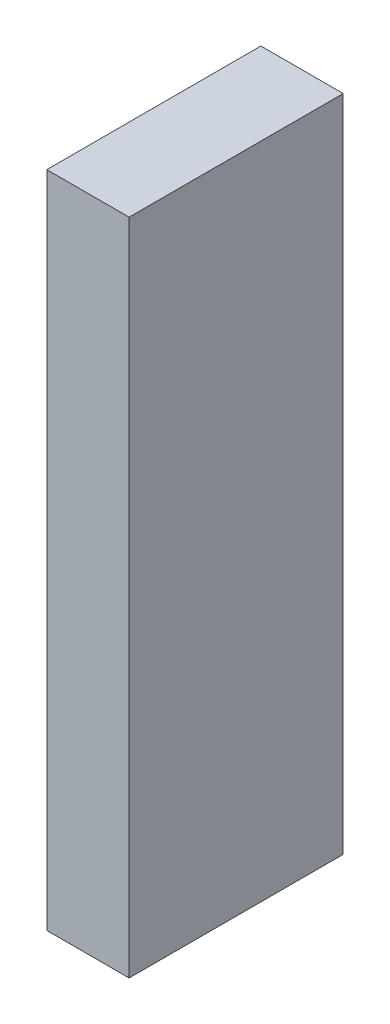
ISO-10303-21;
HEADER;
FILE_DESCRIPTION(('STEP AP214'),'2;1');
FILE_NAME('part.step','',(''),(''),'','','');
FILE_SCHEMA(('AUTOMOTIVE_DESIGN { 1 0 10303 214 1 1 1 1 }'));
ENDSEC;
DATA;
#1=APPLICATION_CONTEXT('core data for automotive mechanical design processes');
#2=APPLICATION_PROTOCOL_DEFINITION('international standard','automotive_design',2000,#1);
#3=PRODUCT_CONTEXT('',#1,'mechanical');
#4=PRODUCT('Part','Part','',(#3));
#5=PRODUCT_RELATED_PRODUCT_CATEGORY('part','',(#4));
#6=PRODUCT_DEFINITION_FORMATION('','',#4);
#7=PRODUCT_DEFINITION_CONTEXT('part definition',#1,'design');
#8=PRODUCT_DEFINITION('design','',#6,#7);
#9=PRODUCT_DEFINITION_SHAPE('','',#8);
#10=(LENGTH_UNIT() NAMED_UNIT(*) SI_UNIT(.MILLI.,.METRE.));
#11=(NAMED_UNIT(*) PLANE_ANGLE_UNIT() SI_UNIT($,.RADIAN.));
#12=(NAMED_UNIT(*) SI_UNIT($,.STERADIAN.) SOLID_ANGLE_UNIT());
#13=UNCERTAINTY_MEASURE_WITH_UNIT(LENGTH_MEASURE(1.E-05),#10,'distance_accuracy_value','');
#14=(GEOMETRIC_REPRESENTATION_CONTEXT(3) GLOBAL_UNCERTAINTY_ASSIGNED_CONTEXT((#13)) GLOBAL_UNIT_ASSIGNED_CONTEXT((#10,
#11,#12)) REPRESENTATION_CONTEXT('',''));
#15=CARTESIAN_POINT('',(0.,0.,0.));
#16=DIRECTION('',(0.,0.,1.));
#17=DIRECTION('',(1.,0.,0.));
#18=AXIS2_PLACEMENT_3D('',#15,#16,#17);
#19=CARTESIAN_POINT('',(3.175,-12.7,-4.1275));
#20=DIRECTION('',(0.,0.,1.));
#21=DIRECTION('',(1.,0.,0.));
#22=AXIS2_PLACEMENT_3D('',#19,#20,#21);
#23=PLANE('',#22);
#24=DIRECTION('',(0.,1.,0.));
#25=VECTOR('',#24,1.);
#26=CARTESIAN_POINT('',(0.,-12.7,-4.1275));
#27=LINE('',#26,#25);
#28=CARTESIAN_POINT('',(0.,-12.7,-4.1275));
#29=VERTEX_POINT('',#28);
#30=CARTESIAN_POINT('',(0.,12.7,-4.1275));
#31=VERTEX_POINT('',#30);
#32=EDGE_CURVE('E96',#29,#31,#27,.T.);
#33=ORIENTED_EDGE('',*,*,#32,.T.);
#34=DIRECTION('',(-1.,0.,0.));
#35=VECTOR('',#34,1.);
#36=CARTESIAN_POINT('',(3.175,12.7,-4.1275));
#37=LINE('',#36,#35);
#38=CARTESIAN_POINT('',(3.175,12.7,-4.1275));
#39=VERTEX_POINT('',#38);
#40=EDGE_CURVE('E11',#39,#31,#37,.T.);
#41=ORIENTED_EDGE('',*,*,#40,.F.);
#42=DIRECTION('',(0.,1.,0.));
#43=VECTOR('',#42,1.);
#44=CARTESIAN_POINT('',(3.175,-12.7,-4.1275));
#45=LINE('',#44,#43);
#46=CARTESIAN_POINT('',(3.175,-12.7,-4.1275));
#47=VERTEX_POINT('',#46);
#48=EDGE_CURVE('E84',#47,#39,#45,.T.);
#49=ORIENTED_EDGE('',*,*,#48,.F.);
#50=DIRECTION('',(-1.,0.,0.));
#51=VECTOR('',#50,1.);
#52=CARTESIAN_POINT('',(3.175,-12.7,-4.1275));
#53=LINE('',#52,#51);
#54=EDGE_CURVE('E92',#47,#29,#53,.T.);
#55=ORIENTED_EDGE('',*,*,#54,.T.);
#56=EDGE_LOOP('',(#33,#41,#49,#55));
#57=FACE_BOUND('',#56,.T.);
#58=ADVANCED_FACE('F33',(#57),#23,.F.);
#59=CARTESIAN_POINT('',(3.175,12.7,4.1275));
#60=DIRECTION('',(0.,-1.,0.));
#61=DIRECTION('',(0.,0.,-1.));
#62=AXIS2_PLACEMENT_3D('',#59,#60,#61);
#63=PLANE('',#62);
#64=DIRECTION('',(0.,0.,1.));
#65=VECTOR('',#64,1.);
#66=CARTESIAN_POINT('',(0.,12.7,4.1275));
#67=LINE('',#66,#65);
#68=CARTESIAN_POINT('',(0.,12.7,4.1275));
#69=VERTEX_POINT('',#68);
#70=EDGE_CURVE('E88',#31,#69,#67,.T.);
#71=ORIENTED_EDGE('',*,*,#70,.T.);
#72=DIRECTION('',(-1.,0.,0.));
#73=VECTOR('',#72,1.);
#74=CARTESIAN_POINT('',(3.175,12.7,4.1275));
#75=LINE('',#74,#73);
#76=CARTESIAN_POINT('',(3.175,12.7,4.1275));
#77=VERTEX_POINT('',#76);
#78=EDGE_CURVE('E41',#77,#69,#75,.T.);
#79=ORIENTED_EDGE('',*,*,#78,.F.);
#80=DIRECTION('',(0.,0.,1.));
#81=VECTOR('',#80,1.);
#82=CARTESIAN_POINT('',(3.175,12.7,4.1275));
#83=LINE('',#82,#81);
#84=EDGE_CURVE('E79',#39,#77,#83,.T.);
#85=ORIENTED_EDGE('',*,*,#84,.F.);
#86=ORIENTED_EDGE('',*,*,#40,.T.);
#87=EDGE_LOOP('',(#71,#79,#85,#86));
#88=FACE_BOUND('',#87,.T.);
#89=ADVANCED_FACE('F87',(#88),#63,.F.);
#90=CARTESIAN_POINT('',(3.175,-12.7,4.1275));
#91=DIRECTION('',(0.,0.,-1.));
#92=DIRECTION('',(-1.,0.,0.));
#93=AXIS2_PLACEMENT_3D('',#90,#91,#92);
#94=PLANE('',#93);
#95=DIRECTION('',(0.,-1.,0.));
#96=VECTOR('',#95,1.);
#97=CARTESIAN_POINT('',(0.,-12.7,4.1275));
#98=LINE('',#97,#96);
#99=CARTESIAN_POINT('',(0.,-12.7,4.1275));
#100=VERTEX_POINT('',#99);
#101=EDGE_CURVE('E66',#69,#100,#98,.T.);
#102=ORIENTED_EDGE('',*,*,#101,.T.);
#103=DIRECTION('',(-1.,0.,0.));
#104=VECTOR('',#103,1.);
#105=CARTESIAN_POINT('',(3.175,-12.7,4.1275));
#106=LINE('',#105,#104);
#107=CARTESIAN_POINT('',(3.175,-12.7,4.1275));
#108=VERTEX_POINT('',#107);
#109=EDGE_CURVE('E89',#108,#100,#106,.T.);
#110=ORIENTED_EDGE('',*,*,#109,.F.);
#111=DIRECTION('',(0.,-1.,0.));
#112=VECTOR('',#111,1.);
#113=CARTESIAN_POINT('',(3.175,-12.7,4.1275));
#114=LINE('',#113,#112);
#115=EDGE_CURVE('E82',#77,#108,#114,.T.);
#116=ORIENTED_EDGE('',*,*,#115,.F.);
#117=ORIENTED_EDGE('',*,*,#78,.T.);
#118=EDGE_LOOP('',(#102,#110,#116,#117));
#119=FACE_BOUND('',#118,.T.);
#120=ADVANCED_FACE('F90',(#119),#94,.F.);
#121=CARTESIAN_POINT('',(3.175,-12.7,4.1275));
#122=DIRECTION('',(0.,1.,0.));
#123=DIRECTION('',(0.,0.,1.));
#124=AXIS2_PLACEMENT_3D('',#121,#122,#123);
#125=PLANE('',#124);
#126=DIRECTION('',(0.,0.,-1.));
#127=VECTOR('',#126,1.);
#128=CARTESIAN_POINT('',(0.,-12.7,4.1275));
#129=LINE('',#128,#127);
#130=EDGE_CURVE('E72',#100,#29,#129,.T.);
#131=ORIENTED_EDGE('',*,*,#130,.T.);
#132=ORIENTED_EDGE('',*,*,#54,.F.);
#133=DIRECTION('',(0.,0.,-1.));
#134=VECTOR('',#133,1.);
#135=CARTESIAN_POINT('',(3.175,-12.7,4.1275));
#136=LINE('',#135,#134);
#137=EDGE_CURVE('E49',#108,#47,#136,.T.);
#138=ORIENTED_EDGE('',*,*,#137,.F.);
#139=ORIENTED_EDGE('',*,*,#109,.T.);
#140=EDGE_LOOP('',(#131,#132,#138,#139));
#141=FACE_BOUND('',#140,.T.);
#142=ADVANCED_FACE('F103',(#141),#125,.F.);
#143=CARTESIAN_POINT('',(3.175,12.7,-4.1275));
#144=DIRECTION('',(-1.,0.,0.));
#145=DIRECTION('',(0.,0.,1.));
#146=AXIS2_PLACEMENT_3D('',#143,#144,#145);
#147=PLANE('',#146);
#148=ORIENTED_EDGE('',*,*,#48,.T.);
#149=ORIENTED_EDGE('',*,*,#84,.T.);
#150=ORIENTED_EDGE('',*,*,#115,.T.);
#151=ORIENTED_EDGE('',*,*,#137,.T.);
#152=EDGE_LOOP('',(#148,#149,#150,#151));
#153=FACE_BOUND('',#152,.T.);
#154=ADVANCED_FACE('F80',(#153),#147,.F.);
#155=CARTESIAN_POINT('',(0.,12.7,-4.1275));
#156=DIRECTION('',(-1.,0.,0.));
#157=DIRECTION('',(0.,0.,1.));
#158=AXIS2_PLACEMENT_3D('',#155,#156,#157);
#159=PLANE('',#158);
#160=ORIENTED_EDGE('',*,*,#32,.F.);
#161=ORIENTED_EDGE('',*,*,#130,.F.);
#162=ORIENTED_EDGE('',*,*,#101,.F.);
#163=ORIENTED_EDGE('',*,*,#70,.F.);
#164=EDGE_LOOP('',(#160,#161,#162,#163));
#165=FACE_BOUND('',#164,.T.);
#166=ADVANCED_FACE('F106',(#165),#159,.T.);
#167=CLOSED_SHELL('',(#58,#89,#120,#142,#154,#166));
#168=MANIFOLD_SOLID_BREP('B2',#167);
#169=ADVANCED_BREP_SHAPE_REPRESENTATION('',(#18,#168),#14);
#170=SHAPE_DEFINITION_REPRESENTATION(#9,#169);
ENDSEC;
END-ISO-10303-21;
